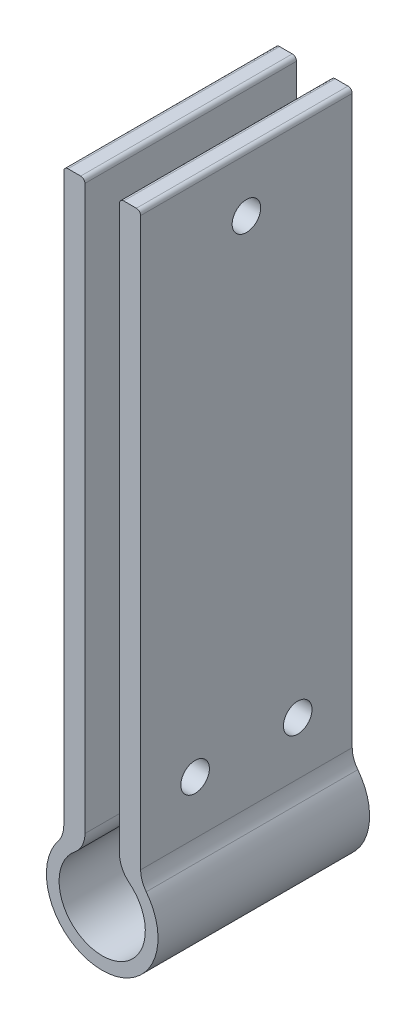
ISO-10303-21;
HEADER;
FILE_DESCRIPTION(('STEP AP214'),'2;1');
FILE_NAME('part.step','',(''),(''),'','','');
FILE_SCHEMA(('AUTOMOTIVE_DESIGN { 1 0 10303 214 1 1 1 1 }'));
ENDSEC;
DATA;
#1=APPLICATION_CONTEXT('core data for automotive mechanical design processes');
#2=APPLICATION_PROTOCOL_DEFINITION('international standard','automotive_design',2000,#1);
#3=PRODUCT_CONTEXT('',#1,'mechanical');
#4=PRODUCT('Part','Part','',(#3));
#5=PRODUCT_RELATED_PRODUCT_CATEGORY('part','',(#4));
#6=PRODUCT_DEFINITION_FORMATION('','',#4);
#7=PRODUCT_DEFINITION_CONTEXT('part definition',#1,'design');
#8=PRODUCT_DEFINITION('design','',#6,#7);
#9=PRODUCT_DEFINITION_SHAPE('','',#8);
#10=(LENGTH_UNIT() NAMED_UNIT(*) SI_UNIT(.MILLI.,.METRE.));
#11=(NAMED_UNIT(*) PLANE_ANGLE_UNIT() SI_UNIT($,.RADIAN.));
#12=(NAMED_UNIT(*) SI_UNIT($,.STERADIAN.) SOLID_ANGLE_UNIT());
#13=UNCERTAINTY_MEASURE_WITH_UNIT(LENGTH_MEASURE(1.E-05),#10,'distance_accuracy_value','');
#14=(GEOMETRIC_REPRESENTATION_CONTEXT(3) GLOBAL_UNCERTAINTY_ASSIGNED_CONTEXT((#13)) GLOBAL_UNIT_ASSIGNED_CONTEXT((#10,
#11,#12)) REPRESENTATION_CONTEXT('',''));
#15=CARTESIAN_POINT('',(0.,0.,0.));
#16=DIRECTION('',(0.,0.,1.));
#17=DIRECTION('',(1.,0.,0.));
#18=AXIS2_PLACEMENT_3D('',#15,#16,#17);
#19=CARTESIAN_POINT('',(3.26601247354487,7.46697144246911,40.));
#20=DIRECTION('',(1.,0.,0.));
#21=DIRECTION('',(0.,0.,-1.));
#22=AXIS2_PLACEMENT_3D('',#19,#20,#21);
#23=PLANE('',#22);
#24=CARTESIAN_POINT('',(3.26601247354487,106.59447777644,20.));
#25=DIRECTION('',(1.,0.,0.));
#26=DIRECTION('',(0.,0.,-1.));
#27=AXIS2_PLACEMENT_3D('',#24,#25,#26);
#28=CIRCLE('',#27,2.69999999999999);
#29=CARTESIAN_POINT('',(3.26601247354487,106.59447777644,17.3));
#30=VERTEX_POINT('',#29);
#31=EDGE_CURVE('E317',#30,#30,#28,.T.);
#32=ORIENTED_EDGE('',*,*,#31,.T.);
#33=EDGE_LOOP('',(#32));
#34=FACE_BOUND('',#33,.T.);
#35=CARTESIAN_POINT('',(3.26601247354487,19.6227536568922,10.2995770141812));
#36=DIRECTION('',(1.,0.,0.));
#37=DIRECTION('',(0.,0.,-1.));
#38=AXIS2_PLACEMENT_3D('',#35,#36,#37);
#39=CIRCLE('',#38,2.7);
#40=CARTESIAN_POINT('',(3.26601247354487,19.6227536568922,7.59957701418123));
#41=VERTEX_POINT('',#40);
#42=EDGE_CURVE('E305',#41,#41,#39,.T.);
#43=ORIENTED_EDGE('',*,*,#42,.T.);
#44=EDGE_LOOP('',(#43));
#45=FACE_BOUND('',#44,.T.);
#46=CARTESIAN_POINT('',(3.26601247354487,19.6227536568922,29.7004229858188));
#47=DIRECTION('',(1.,0.,0.));
#48=DIRECTION('',(0.,0.,-1.));
#49=AXIS2_PLACEMENT_3D('',#46,#47,#48);
#50=CIRCLE('',#49,2.7);
#51=CARTESIAN_POINT('',(3.26601247354487,19.6227536568922,27.0004229858188));
#52=VERTEX_POINT('',#51);
#53=EDGE_CURVE('E278',#52,#52,#50,.T.);
#54=ORIENTED_EDGE('',*,*,#53,.T.);
#55=EDGE_LOOP('',(#54));
#56=FACE_BOUND('',#55,.T.);
#57=DIRECTION('',(0.,-1.,0.));
#58=VECTOR('',#57,1.);
#59=CARTESIAN_POINT('',(3.26601247354487,7.46697144246911,40.));
#60=LINE('',#59,#58);
#61=CARTESIAN_POINT('',(3.26601247354487,116.666971442469,40.));
#62=VERTEX_POINT('',#61);
#63=CARTESIAN_POINT('',(3.26601247354487,10.2271959885005,40.));
#64=VERTEX_POINT('',#63);
#65=EDGE_CURVE('E196',#62,#64,#60,.T.);
#66=ORIENTED_EDGE('',*,*,#65,.F.);
#67=DIRECTION('',(0.,0.,-1.));
#68=VECTOR('',#67,1.);
#69=CARTESIAN_POINT('',(3.26601247354487,116.666971442469,40.));
#70=LINE('',#69,#68);
#71=CARTESIAN_POINT('',(3.26601247354487,116.666971442469,0.));
#72=VERTEX_POINT('',#71);
#73=EDGE_CURVE('E254',#62,#72,#70,.T.);
#74=ORIENTED_EDGE('',*,*,#73,.T.);
#75=DIRECTION('',(0.,-1.,0.));
#76=VECTOR('',#75,1.);
#77=CARTESIAN_POINT('',(3.26601247354487,7.46697144246911,0.));
#78=LINE('',#77,#76);
#79=CARTESIAN_POINT('',(3.26601247354487,10.2271959885005,0.));
#80=VERTEX_POINT('',#79);
#81=EDGE_CURVE('E184',#72,#80,#78,.T.);
#82=ORIENTED_EDGE('',*,*,#81,.T.);
#83=DIRECTION('',(0.,0.,-1.));
#84=VECTOR('',#83,1.);
#85=CARTESIAN_POINT('',(3.26601247354487,10.2271959885005,40.));
#86=LINE('',#85,#84);
#87=EDGE_CURVE('E207',#80,#64,#86,.F.);
#88=ORIENTED_EDGE('',*,*,#87,.T.);
#89=EDGE_LOOP('',(#66,#74,#82,#88));
#90=FACE_BOUND('',#89,.T.);
#91=ADVANCED_FACE('F37',(#34,#45,#56,#90),#23,.F.);
#92=CARTESIAN_POINT('',(0.,0.,40.));
#93=DIRECTION('',(0.,0.,-1.));
#94=DIRECTION('',(-1.,0.,0.));
#95=AXIS2_PLACEMENT_3D('',#92,#93,#94);
#96=CYLINDRICAL_SURFACE('',#95,8.15);
#97=CARTESIAN_POINT('',(0.,0.,0.));
#98=DIRECTION('',(0.,0.,-1.));
#99=DIRECTION('',(1.,0.,0.));
#100=AXIS2_PLACEMENT_3D('',#97,#98,#99);
#101=CIRCLE('',#100,8.15);
#102=CARTESIAN_POINT('',(5.12304195128446,6.33852831226456,0.));
#103=VERTEX_POINT('',#102);
#104=CARTESIAN_POINT('',(-5.12304195128446,6.33852831226456,0.));
#105=VERTEX_POINT('',#104);
#106=EDGE_CURVE('E179',#103,#105,#101,.T.);
#107=ORIENTED_EDGE('',*,*,#106,.T.);
#108=DIRECTION('',(0.,0.,-1.));
#109=VECTOR('',#108,1.);
#110=CARTESIAN_POINT('',(-5.12304195128446,6.33852831226457,40.));
#111=LINE('',#110,#109);
#112=CARTESIAN_POINT('',(-5.12304195128446,6.33852831226456,40.));
#113=VERTEX_POINT('',#112);
#114=EDGE_CURVE('E156',#105,#113,#111,.F.);
#115=ORIENTED_EDGE('',*,*,#114,.T.);
#116=CARTESIAN_POINT('',(0.,0.,40.));
#117=DIRECTION('',(0.,0.,-1.));
#118=DIRECTION('',(1.,0.,0.));
#119=AXIS2_PLACEMENT_3D('',#116,#117,#118);
#120=CIRCLE('',#119,8.15);
#121=CARTESIAN_POINT('',(5.12304195128446,6.33852831226456,40.));
#122=VERTEX_POINT('',#121);
#123=EDGE_CURVE('E273',#122,#113,#120,.T.);
#124=ORIENTED_EDGE('',*,*,#123,.F.);
#125=DIRECTION('',(0.,0.,-1.));
#126=VECTOR('',#125,1.);
#127=CARTESIAN_POINT('',(5.12304195128446,6.33852831226457,40.));
#128=LINE('',#127,#126);
#129=EDGE_CURVE('E161',#122,#103,#128,.T.);
#130=ORIENTED_EDGE('',*,*,#129,.T.);
#131=EDGE_LOOP('',(#107,#115,#124,#130));
#132=FACE_BOUND('',#131,.T.);
#133=ADVANCED_FACE('F361',(#132),#96,.F.);
#134=CARTESIAN_POINT('',(-3.26601247354487,7.46697144246912,40.));
#135=DIRECTION('',(-1.,0.,0.));
#136=DIRECTION('',(0.,0.,1.));
#137=AXIS2_PLACEMENT_3D('',#134,#135,#136);
#138=PLANE('',#137);
#139=CARTESIAN_POINT('',(-3.26601247354487,106.59447777644,20.));
#140=DIRECTION('',(-1.,0.,0.));
#141=DIRECTION('',(0.,0.,1.));
#142=AXIS2_PLACEMENT_3D('',#139,#140,#141);
#143=CIRCLE('',#142,2.69999999999999);
#144=CARTESIAN_POINT('',(-3.26601247354487,106.59447777644,22.7));
#145=VERTEX_POINT('',#144);
#146=EDGE_CURVE('E320',#145,#145,#143,.T.);
#147=ORIENTED_EDGE('',*,*,#146,.T.);
#148=EDGE_LOOP('',(#147));
#149=FACE_BOUND('',#148,.T.);
#150=CARTESIAN_POINT('',(-3.26601247354487,19.6227536568922,10.2995770141812));
#151=DIRECTION('',(-1.,0.,0.));
#152=DIRECTION('',(0.,0.,1.));
#153=AXIS2_PLACEMENT_3D('',#150,#151,#152);
#154=CIRCLE('',#153,2.7);
#155=CARTESIAN_POINT('',(-3.26601247354487,19.6227536568922,12.9995770141812));
#156=VERTEX_POINT('',#155);
#157=EDGE_CURVE('E308',#156,#156,#154,.T.);
#158=ORIENTED_EDGE('',*,*,#157,.T.);
#159=EDGE_LOOP('',(#158));
#160=FACE_BOUND('',#159,.T.);
#161=CARTESIAN_POINT('',(-3.26601247354487,19.6227536568922,29.7004229858188));
#162=DIRECTION('',(-1.,0.,0.));
#163=DIRECTION('',(0.,0.,1.));
#164=AXIS2_PLACEMENT_3D('',#161,#162,#163);
#165=CIRCLE('',#164,2.7);
#166=CARTESIAN_POINT('',(-3.26601247354487,19.6227536568922,32.4004229858188));
#167=VERTEX_POINT('',#166);
#168=EDGE_CURVE('E294',#167,#167,#165,.T.);
#169=ORIENTED_EDGE('',*,*,#168,.T.);
#170=EDGE_LOOP('',(#169));
#171=FACE_BOUND('',#170,.T.);
#172=DIRECTION('',(0.,1.,0.));
#173=VECTOR('',#172,1.);
#174=CARTESIAN_POINT('',(-3.26601247354487,7.46697144246912,0.));
#175=LINE('',#174,#173);
#176=CARTESIAN_POINT('',(-3.26601247354487,10.2271959885005,0.));
#177=VERTEX_POINT('',#176);
#178=CARTESIAN_POINT('',(-3.26601247354487,116.666971442469,0.));
#179=VERTEX_POINT('',#178);
#180=EDGE_CURVE('E168',#177,#179,#175,.T.);
#181=ORIENTED_EDGE('',*,*,#180,.T.);
#182=DIRECTION('',(0.,0.,-1.));
#183=VECTOR('',#182,1.);
#184=CARTESIAN_POINT('',(-3.26601247354487,116.666971442469,40.));
#185=LINE('',#184,#183);
#186=CARTESIAN_POINT('',(-3.26601247354487,116.666971442469,40.));
#187=VERTEX_POINT('',#186);
#188=EDGE_CURVE('E252',#179,#187,#185,.F.);
#189=ORIENTED_EDGE('',*,*,#188,.T.);
#190=DIRECTION('',(0.,1.,0.));
#191=VECTOR('',#190,1.);
#192=CARTESIAN_POINT('',(-3.26601247354487,7.46697144246912,40.));
#193=LINE('',#192,#191);
#194=CARTESIAN_POINT('',(-3.26601247354487,10.2271959885005,40.));
#195=VERTEX_POINT('',#194);
#196=EDGE_CURVE('E171',#195,#187,#193,.T.);
#197=ORIENTED_EDGE('',*,*,#196,.F.);
#198=DIRECTION('',(0.,0.,-1.));
#199=VECTOR('',#198,1.);
#200=CARTESIAN_POINT('',(-3.26601247354487,10.2271959885005,40.));
#201=LINE('',#200,#199);
#202=EDGE_CURVE('E155',#195,#177,#201,.T.);
#203=ORIENTED_EDGE('',*,*,#202,.T.);
#204=EDGE_LOOP('',(#181,#189,#197,#203));
#205=FACE_BOUND('',#204,.T.);
#206=ADVANCED_FACE('F167',(#149,#160,#171,#205),#138,.F.);
#207=CARTESIAN_POINT('',(-3.26601247354487,117.466971442469,40.));
#208=DIRECTION('',(0.,-1.,0.));
#209=DIRECTION('',(0.,0.,-1.));
#210=AXIS2_PLACEMENT_3D('',#207,#208,#209);
#211=PLANE('',#210);
#212=DIRECTION('',(-1.,0.,0.));
#213=VECTOR('',#212,1.);
#214=CARTESIAN_POINT('',(-3.26601247354487,117.466971442469,0.));
#215=LINE('',#214,#213);
#216=CARTESIAN_POINT('',(-4.06601247354487,117.466971442469,0.));
#217=VERTEX_POINT('',#216);
#218=CARTESIAN_POINT('',(-6.46601247354487,117.466971442469,0.));
#219=VERTEX_POINT('',#218);
#220=EDGE_CURVE('E178',#217,#219,#215,.T.);
#221=ORIENTED_EDGE('',*,*,#220,.T.);
#222=DIRECTION('',(0.,0.,-1.));
#223=VECTOR('',#222,1.);
#224=CARTESIAN_POINT('',(-6.46601247354487,117.466971442469,40.));
#225=LINE('',#224,#223);
#226=CARTESIAN_POINT('',(-6.46601247354487,117.466971442469,40.));
#227=VERTEX_POINT('',#226);
#228=EDGE_CURVE('E243',#219,#227,#225,.F.);
#229=ORIENTED_EDGE('',*,*,#228,.T.);
#230=DIRECTION('',(-1.,0.,0.));
#231=VECTOR('',#230,1.);
#232=CARTESIAN_POINT('',(-3.26601247354487,117.466971442469,40.));
#233=LINE('',#232,#231);
#234=CARTESIAN_POINT('',(-4.06601247354487,117.466971442469,40.));
#235=VERTEX_POINT('',#234);
#236=EDGE_CURVE('E282',#235,#227,#233,.T.);
#237=ORIENTED_EDGE('',*,*,#236,.F.);
#238=DIRECTION('',(0.,0.,-1.));
#239=VECTOR('',#238,1.);
#240=CARTESIAN_POINT('',(-4.06601247354487,117.466971442469,40.));
#241=LINE('',#240,#239);
#242=EDGE_CURVE('E240',#235,#217,#241,.T.);
#243=ORIENTED_EDGE('',*,*,#242,.T.);
#244=EDGE_LOOP('',(#221,#229,#237,#243));
#245=FACE_BOUND('',#244,.T.);
#246=ADVANCED_FACE('F337',(#245),#211,.F.);
#247=CARTESIAN_POINT('',(-7.26601247354487,117.466971442469,40.));
#248=DIRECTION('',(1.,0.,0.));
#249=DIRECTION('',(0.,1.,0.));
#250=AXIS2_PLACEMENT_3D('',#247,#248,#249);
#251=PLANE('',#250);
#252=CARTESIAN_POINT('',(-7.26601247354486,106.59447777644,20.));
#253=DIRECTION('',(-1.,0.,0.));
#254=DIRECTION('',(0.,0.,1.));
#255=AXIS2_PLACEMENT_3D('',#252,#253,#254);
#256=CIRCLE('',#255,2.69999999999999);
#257=CARTESIAN_POINT('',(-7.26601247354486,106.59447777644,22.7));
#258=VERTEX_POINT('',#257);
#259=EDGE_CURVE('E326',#258,#258,#256,.T.);
#260=ORIENTED_EDGE('',*,*,#259,.F.);
#261=EDGE_LOOP('',(#260));
#262=FACE_BOUND('',#261,.T.);
#263=CARTESIAN_POINT('',(-7.26601247354486,19.6227536568922,10.2995770141812));
#264=DIRECTION('',(-1.,0.,0.));
#265=DIRECTION('',(0.,0.,1.));
#266=AXIS2_PLACEMENT_3D('',#263,#264,#265);
#267=CIRCLE('',#266,2.7);
#268=CARTESIAN_POINT('',(-7.26601247354486,19.6227536568922,12.9995770141812));
#269=VERTEX_POINT('',#268);
#270=EDGE_CURVE('E314',#269,#269,#267,.T.);
#271=ORIENTED_EDGE('',*,*,#270,.F.);
#272=EDGE_LOOP('',(#271));
#273=FACE_BOUND('',#272,.T.);
#274=CARTESIAN_POINT('',(-7.26601247354486,19.6227536568922,29.7004229858188));
#275=DIRECTION('',(-1.,0.,0.));
#276=DIRECTION('',(0.,0.,1.));
#277=AXIS2_PLACEMENT_3D('',#274,#275,#276);
#278=CIRCLE('',#277,2.7);
#279=CARTESIAN_POINT('',(-7.26601247354486,19.6227536568922,32.4004229858188));
#280=VERTEX_POINT('',#279);
#281=EDGE_CURVE('E301',#280,#280,#278,.T.);
#282=ORIENTED_EDGE('',*,*,#281,.F.);
#283=EDGE_LOOP('',(#282));
#284=FACE_BOUND('',#283,.T.);
#285=DIRECTION('',(0.,-1.,0.));
#286=VECTOR('',#285,1.);
#287=CARTESIAN_POINT('',(-7.26601247354487,117.466971442469,40.));
#288=LINE('',#287,#286);
#289=CARTESIAN_POINT('',(-7.26601247354487,116.666971442469,40.));
#290=VERTEX_POINT('',#289);
#291=CARTESIAN_POINT('',(-7.26601247354486,9.55758536445488,40.));
#292=VERTEX_POINT('',#291);
#293=EDGE_CURVE('E285',#290,#292,#288,.T.);
#294=ORIENTED_EDGE('',*,*,#293,.F.);
#295=DIRECTION('',(0.,0.,-1.));
#296=VECTOR('',#295,1.);
#297=CARTESIAN_POINT('',(-7.26601247354487,116.666971442469,40.));
#298=LINE('',#297,#296);
#299=CARTESIAN_POINT('',(-7.26601247354487,116.666971442469,0.));
#300=VERTEX_POINT('',#299);
#301=EDGE_CURVE('E230',#290,#300,#298,.T.);
#302=ORIENTED_EDGE('',*,*,#301,.T.);
#303=DIRECTION('',(0.,-1.,0.));
#304=VECTOR('',#303,1.);
#305=CARTESIAN_POINT('',(-7.26601247354487,117.466971442469,0.));
#306=LINE('',#305,#304);
#307=CARTESIAN_POINT('',(-7.26601247354486,9.55758536445488,0.));
#308=VERTEX_POINT('',#307);
#309=EDGE_CURVE('E182',#300,#308,#306,.T.);
#310=ORIENTED_EDGE('',*,*,#309,.T.);
#311=DIRECTION('',(0.,0.,1.));
#312=VECTOR('',#311,1.);
#313=CARTESIAN_POINT('',(-7.26601247354486,9.55758536445488,40.));
#314=LINE('',#313,#312);
#315=EDGE_CURVE('E215',#308,#292,#314,.T.);
#316=ORIENTED_EDGE('',*,*,#315,.T.);
#317=EDGE_LOOP('',(#294,#302,#310,#316));
#318=FACE_BOUND('',#317,.T.);
#319=ADVANCED_FACE('F333',(#262,#273,#284,#318),#251,.F.);
#320=CARTESIAN_POINT('',(0.,0.,40.));
#321=DIRECTION('',(0.,0.,-1.));
#322=DIRECTION('',(-1.,0.,0.));
#323=AXIS2_PLACEMENT_3D('',#320,#321,#322);
#324=CYLINDRICAL_SURFACE('',#323,10.55);
#325=CARTESIAN_POINT('',(0.,0.,40.));
#326=DIRECTION('',(0.,0.,1.));
#327=DIRECTION('',(1.,0.,0.));
#328=AXIS2_PLACEMENT_3D('',#325,#326,#327);
#329=CIRCLE('',#328,10.55);
#330=CARTESIAN_POINT('',(-8.32195701581339,6.48440679067517,40.));
#331=VERTEX_POINT('',#330);
#332=CARTESIAN_POINT('',(8.32195701581339,6.48440679067517,40.));
#333=VERTEX_POINT('',#332);
#334=EDGE_CURVE('E287',#331,#333,#329,.T.);
#335=ORIENTED_EDGE('',*,*,#334,.F.);
#336=DIRECTION('',(0.,0.,-1.));
#337=VECTOR('',#336,1.);
#338=CARTESIAN_POINT('',(-8.32195701581339,6.48440679067517,40.));
#339=LINE('',#338,#337);
#340=CARTESIAN_POINT('',(-8.32195701581339,6.48440679067517,0.));
#341=VERTEX_POINT('',#340);
#342=EDGE_CURVE('E212',#331,#341,#339,.T.);
#343=ORIENTED_EDGE('',*,*,#342,.T.);
#344=CARTESIAN_POINT('',(0.,0.,0.));
#345=DIRECTION('',(0.,0.,1.));
#346=DIRECTION('',(1.,0.,0.));
#347=AXIS2_PLACEMENT_3D('',#344,#345,#346);
#348=CIRCLE('',#347,10.55);
#349=CARTESIAN_POINT('',(8.32195701581339,6.48440679067517,0.));
#350=VERTEX_POINT('',#349);
#351=EDGE_CURVE('E189',#341,#350,#348,.T.);
#352=ORIENTED_EDGE('',*,*,#351,.T.);
#353=DIRECTION('',(0.,0.,-1.));
#354=VECTOR('',#353,1.);
#355=CARTESIAN_POINT('',(8.32195701581339,6.48440679067517,40.));
#356=LINE('',#355,#354);
#357=EDGE_CURVE('E210',#350,#333,#356,.F.);
#358=ORIENTED_EDGE('',*,*,#357,.T.);
#359=EDGE_LOOP('',(#335,#343,#352,#358));
#360=FACE_BOUND('',#359,.T.);
#361=ADVANCED_FACE('F336',(#360),#324,.T.);
#362=CARTESIAN_POINT('',(7.26601247354487,117.466971442469,40.));
#363=DIRECTION('',(-1.,0.,0.));
#364=DIRECTION('',(0.,-1.,0.));
#365=AXIS2_PLACEMENT_3D('',#362,#363,#364);
#366=PLANE('',#365);
#367=CARTESIAN_POINT('',(7.26601247354487,106.59447777644,20.));
#368=DIRECTION('',(-1.,0.,0.));
#369=DIRECTION('',(0.,-1.,0.));
#370=AXIS2_PLACEMENT_3D('',#367,#368,#369);
#371=CIRCLE('',#370,2.69999999999999);
#372=CARTESIAN_POINT('',(7.26601247354487,103.89447777644,20.));
#373=VERTEX_POINT('',#372);
#374=EDGE_CURVE('E323',#373,#373,#371,.T.);
#375=ORIENTED_EDGE('',*,*,#374,.T.);
#376=EDGE_LOOP('',(#375));
#377=FACE_BOUND('',#376,.T.);
#378=CARTESIAN_POINT('',(7.26601247354486,19.6227536568922,10.2995770141812));
#379=DIRECTION('',(-1.,0.,0.));
#380=DIRECTION('',(0.,-1.,0.));
#381=AXIS2_PLACEMENT_3D('',#378,#379,#380);
#382=CIRCLE('',#381,2.7);
#383=CARTESIAN_POINT('',(7.26601247354486,16.9227536568922,10.2995770141812));
#384=VERTEX_POINT('',#383);
#385=EDGE_CURVE('E311',#384,#384,#382,.T.);
#386=ORIENTED_EDGE('',*,*,#385,.T.);
#387=EDGE_LOOP('',(#386));
#388=FACE_BOUND('',#387,.T.);
#389=CARTESIAN_POINT('',(7.26601247354486,19.6227536568922,29.7004229858188));
#390=DIRECTION('',(-1.,0.,0.));
#391=DIRECTION('',(0.,-1.,0.));
#392=AXIS2_PLACEMENT_3D('',#389,#390,#391);
#393=CIRCLE('',#392,2.7);
#394=CARTESIAN_POINT('',(7.26601247354486,16.9227536568922,29.7004229858188));
#395=VERTEX_POINT('',#394);
#396=EDGE_CURVE('E41',#395,#395,#393,.T.);
#397=ORIENTED_EDGE('',*,*,#396,.T.);
#398=EDGE_LOOP('',(#397));
#399=FACE_BOUND('',#398,.T.);
#400=DIRECTION('',(0.,1.,0.));
#401=VECTOR('',#400,1.);
#402=CARTESIAN_POINT('',(7.26601247354487,117.466971442469,0.));
#403=LINE('',#402,#401);
#404=CARTESIAN_POINT('',(7.26601247354486,9.55758536445488,0.));
#405=VERTEX_POINT('',#404);
#406=CARTESIAN_POINT('',(7.26601247354487,116.666971442469,0.));
#407=VERTEX_POINT('',#406);
#408=EDGE_CURVE('E192',#405,#407,#403,.T.);
#409=ORIENTED_EDGE('',*,*,#408,.T.);
#410=DIRECTION('',(0.,0.,-1.));
#411=VECTOR('',#410,1.);
#412=CARTESIAN_POINT('',(7.26601247354487,116.666971442469,40.));
#413=LINE('',#412,#411);
#414=CARTESIAN_POINT('',(7.26601247354487,116.666971442469,40.));
#415=VERTEX_POINT('',#414);
#416=EDGE_CURVE('E11',#407,#415,#413,.F.);
#417=ORIENTED_EDGE('',*,*,#416,.T.);
#418=DIRECTION('',(0.,1.,0.));
#419=VECTOR('',#418,1.);
#420=CARTESIAN_POINT('',(7.26601247354487,117.466971442469,40.));
#421=LINE('',#420,#419);
#422=CARTESIAN_POINT('',(7.26601247354486,9.55758536445488,40.));
#423=VERTEX_POINT('',#422);
#424=EDGE_CURVE('E290',#423,#415,#421,.T.);
#425=ORIENTED_EDGE('',*,*,#424,.F.);
#426=DIRECTION('',(0.,0.,1.));
#427=VECTOR('',#426,1.);
#428=CARTESIAN_POINT('',(7.26601247354486,9.55758536445488,0.));
#429=LINE('',#428,#427);
#430=EDGE_CURVE('E218',#423,#405,#429,.F.);
#431=ORIENTED_EDGE('',*,*,#430,.T.);
#432=EDGE_LOOP('',(#409,#417,#425,#431));
#433=FACE_BOUND('',#432,.T.);
#434=ADVANCED_FACE('F391',(#377,#388,#399,#433),#366,.F.);
#435=CARTESIAN_POINT('',(3.26601247354487,117.466971442469,40.));
#436=DIRECTION('',(0.,-1.,0.));
#437=DIRECTION('',(0.,0.,-1.));
#438=AXIS2_PLACEMENT_3D('',#435,#436,#437);
#439=PLANE('',#438);
#440=DIRECTION('',(-1.,0.,0.));
#441=VECTOR('',#440,1.);
#442=CARTESIAN_POINT('',(3.26601247354487,117.466971442469,0.));
#443=LINE('',#442,#441);
#444=CARTESIAN_POINT('',(6.46601247354487,117.466971442469,0.));
#445=VERTEX_POINT('',#444);
#446=CARTESIAN_POINT('',(4.06601247354487,117.466971442469,0.));
#447=VERTEX_POINT('',#446);
#448=EDGE_CURVE('E195',#445,#447,#443,.T.);
#449=ORIENTED_EDGE('',*,*,#448,.T.);
#450=DIRECTION('',(0.,0.,-1.));
#451=VECTOR('',#450,1.);
#452=CARTESIAN_POINT('',(4.06601247354487,117.466971442469,40.));
#453=LINE('',#452,#451);
#454=CARTESIAN_POINT('',(4.06601247354487,117.466971442469,40.));
#455=VERTEX_POINT('',#454);
#456=EDGE_CURVE('E46',#447,#455,#453,.F.);
#457=ORIENTED_EDGE('',*,*,#456,.T.);
#458=DIRECTION('',(-1.,0.,0.));
#459=VECTOR('',#458,1.);
#460=CARTESIAN_POINT('',(3.26601247354487,117.466971442469,40.));
#461=LINE('',#460,#459);
#462=CARTESIAN_POINT('',(6.46601247354487,117.466971442469,40.));
#463=VERTEX_POINT('',#462);
#464=EDGE_CURVE('E172',#463,#455,#461,.T.);
#465=ORIENTED_EDGE('',*,*,#464,.F.);
#466=DIRECTION('',(0.,0.,-1.));
#467=VECTOR('',#466,1.);
#468=CARTESIAN_POINT('',(6.46601247354487,117.466971442469,40.));
#469=LINE('',#468,#467);
#470=EDGE_CURVE('E257',#463,#445,#469,.T.);
#471=ORIENTED_EDGE('',*,*,#470,.T.);
#472=EDGE_LOOP('',(#449,#457,#465,#471));
#473=FACE_BOUND('',#472,.T.);
#474=ADVANCED_FACE('F262',(#473),#439,.F.);
#475=CARTESIAN_POINT('',(0.,0.,40.));
#476=DIRECTION('',(0.,0.,1.));
#477=DIRECTION('',(1.,0.,0.));
#478=AXIS2_PLACEMENT_3D('',#475,#476,#477);
#479=PLANE('',#478);
#480=ORIENTED_EDGE('',*,*,#236,.T.);
#481=CARTESIAN_POINT('',(-6.46601247354487,116.666971442469,40.));
#482=DIRECTION('',(0.,0.,1.));
#483=DIRECTION('',(1.,0.,0.));
#484=AXIS2_PLACEMENT_3D('',#481,#482,#483);
#485=CIRCLE('',#484,0.8);
#486=EDGE_CURVE('E250',#227,#290,#485,.T.);
#487=ORIENTED_EDGE('',*,*,#486,.T.);
#488=ORIENTED_EDGE('',*,*,#293,.T.);
#489=CARTESIAN_POINT('',(-12.2660124735449,9.55758536445488,40.));
#490=DIRECTION('',(0.,0.,1.));
#491=DIRECTION('',(1.,0.,0.));
#492=AXIS2_PLACEMENT_3D('',#489,#490,#491);
#493=CIRCLE('',#492,5.);
#494=EDGE_CURVE('E224',#292,#331,#493,.F.);
#495=ORIENTED_EDGE('',*,*,#494,.T.);
#496=ORIENTED_EDGE('',*,*,#334,.T.);
#497=CARTESIAN_POINT('',(12.2660124735449,9.55758536445488,40.));
#498=DIRECTION('',(0.,0.,1.));
#499=DIRECTION('',(1.,0.,0.));
#500=AXIS2_PLACEMENT_3D('',#497,#498,#499);
#501=CIRCLE('',#500,5.);
#502=EDGE_CURVE('E228',#333,#423,#501,.F.);
#503=ORIENTED_EDGE('',*,*,#502,.T.);
#504=ORIENTED_EDGE('',*,*,#424,.T.);
#505=CARTESIAN_POINT('',(6.46601247354487,116.666971442469,40.));
#506=DIRECTION('',(0.,0.,1.));
#507=DIRECTION('',(1.,0.,0.));
#508=AXIS2_PLACEMENT_3D('',#505,#506,#507);
#509=CIRCLE('',#508,0.8);
#510=EDGE_CURVE('E245',#415,#463,#509,.T.);
#511=ORIENTED_EDGE('',*,*,#510,.T.);
#512=ORIENTED_EDGE('',*,*,#464,.T.);
#513=CARTESIAN_POINT('',(4.06601247354487,116.666971442469,40.));
#514=DIRECTION('',(0.,0.,1.));
#515=DIRECTION('',(1.,0.,0.));
#516=AXIS2_PLACEMENT_3D('',#513,#514,#515);
#517=CIRCLE('',#516,0.8);
#518=EDGE_CURVE('E53',#455,#62,#517,.T.);
#519=ORIENTED_EDGE('',*,*,#518,.T.);
#520=ORIENTED_EDGE('',*,*,#65,.T.);
#521=CARTESIAN_POINT('',(8.26601247354487,10.2271959885005,40.));
#522=DIRECTION('',(0.,0.,1.));
#523=DIRECTION('',(1.,0.,0.));
#524=AXIS2_PLACEMENT_3D('',#521,#522,#523);
#525=CIRCLE('',#524,5.);
#526=EDGE_CURVE('E203',#64,#122,#525,.T.);
#527=ORIENTED_EDGE('',*,*,#526,.T.);
#528=ORIENTED_EDGE('',*,*,#123,.T.);
#529=CARTESIAN_POINT('',(-8.26601247354487,10.2271959885005,40.));
#530=DIRECTION('',(0.,0.,1.));
#531=DIRECTION('',(1.,0.,0.));
#532=AXIS2_PLACEMENT_3D('',#529,#530,#531);
#533=CIRCLE('',#532,5.);
#534=EDGE_CURVE('E205',#113,#195,#533,.T.);
#535=ORIENTED_EDGE('',*,*,#534,.T.);
#536=ORIENTED_EDGE('',*,*,#196,.T.);
#537=CARTESIAN_POINT('',(-4.06601247354487,116.666971442469,40.));
#538=DIRECTION('',(0.,0.,1.));
#539=DIRECTION('',(1.,0.,0.));
#540=AXIS2_PLACEMENT_3D('',#537,#538,#539);
#541=CIRCLE('',#540,0.8);
#542=EDGE_CURVE('E248',#187,#235,#541,.T.);
#543=ORIENTED_EDGE('',*,*,#542,.T.);
#544=EDGE_LOOP('',(#480,#487,#488,#495,#496,#503,#504,#511,#512,#519,#520,#527,#528,#535,#536,#543));
#545=FACE_BOUND('',#544,.T.);
#546=ADVANCED_FACE('F357',(#545),#479,.T.);
#547=CARTESIAN_POINT('',(0.,0.,0.));
#548=DIRECTION('',(0.,0.,1.));
#549=DIRECTION('',(1.,0.,0.));
#550=AXIS2_PLACEMENT_3D('',#547,#548,#549);
#551=PLANE('',#550);
#552=ORIENTED_EDGE('',*,*,#309,.F.);
#553=CARTESIAN_POINT('',(-6.46601247354487,116.666971442469,0.));
#554=DIRECTION('',(0.,0.,1.));
#555=DIRECTION('',(1.,0.,0.));
#556=AXIS2_PLACEMENT_3D('',#553,#554,#555);
#557=CIRCLE('',#556,0.8);
#558=EDGE_CURVE('E238',#300,#219,#557,.F.);
#559=ORIENTED_EDGE('',*,*,#558,.T.);
#560=ORIENTED_EDGE('',*,*,#220,.F.);
#561=CARTESIAN_POINT('',(-4.06601247354487,116.666971442469,0.));
#562=DIRECTION('',(0.,0.,1.));
#563=DIRECTION('',(1.,0.,0.));
#564=AXIS2_PLACEMENT_3D('',#561,#562,#563);
#565=CIRCLE('',#564,0.8);
#566=EDGE_CURVE('E177',#217,#179,#565,.F.);
#567=ORIENTED_EDGE('',*,*,#566,.T.);
#568=ORIENTED_EDGE('',*,*,#180,.F.);
#569=CARTESIAN_POINT('',(-8.26601247354487,10.2271959885005,0.));
#570=DIRECTION('',(0.,0.,1.));
#571=DIRECTION('',(1.,0.,0.));
#572=AXIS2_PLACEMENT_3D('',#569,#570,#571);
#573=CIRCLE('',#572,5.);
#574=EDGE_CURVE('E151',#177,#105,#573,.F.);
#575=ORIENTED_EDGE('',*,*,#574,.T.);
#576=ORIENTED_EDGE('',*,*,#106,.F.);
#577=CARTESIAN_POINT('',(8.26601247354487,10.2271959885005,0.));
#578=DIRECTION('',(0.,0.,1.));
#579=DIRECTION('',(1.,0.,0.));
#580=AXIS2_PLACEMENT_3D('',#577,#578,#579);
#581=CIRCLE('',#580,5.);
#582=EDGE_CURVE('E162',#103,#80,#581,.F.);
#583=ORIENTED_EDGE('',*,*,#582,.T.);
#584=ORIENTED_EDGE('',*,*,#81,.F.);
#585=CARTESIAN_POINT('',(4.06601247354487,116.666971442469,0.));
#586=DIRECTION('',(0.,0.,1.));
#587=DIRECTION('',(1.,0.,0.));
#588=AXIS2_PLACEMENT_3D('',#585,#586,#587);
#589=CIRCLE('',#588,0.8);
#590=EDGE_CURVE('E235',#72,#447,#589,.F.);
#591=ORIENTED_EDGE('',*,*,#590,.T.);
#592=ORIENTED_EDGE('',*,*,#448,.F.);
#593=CARTESIAN_POINT('',(6.46601247354487,116.666971442469,0.));
#594=DIRECTION('',(0.,0.,1.));
#595=DIRECTION('',(1.,0.,0.));
#596=AXIS2_PLACEMENT_3D('',#593,#594,#595);
#597=CIRCLE('',#596,0.8);
#598=EDGE_CURVE('E233',#445,#407,#597,.F.);
#599=ORIENTED_EDGE('',*,*,#598,.T.);
#600=ORIENTED_EDGE('',*,*,#408,.F.);
#601=CARTESIAN_POINT('',(12.2660124735449,9.55758536445488,0.));
#602=DIRECTION('',(0.,0.,1.));
#603=DIRECTION('',(1.,0.,0.));
#604=AXIS2_PLACEMENT_3D('',#601,#602,#603);
#605=CIRCLE('',#604,5.);
#606=EDGE_CURVE('E226',#405,#350,#605,.T.);
#607=ORIENTED_EDGE('',*,*,#606,.T.);
#608=ORIENTED_EDGE('',*,*,#351,.F.);
#609=CARTESIAN_POINT('',(-12.2660124735449,9.55758536445488,0.));
#610=DIRECTION('',(0.,0.,1.));
#611=DIRECTION('',(1.,0.,0.));
#612=AXIS2_PLACEMENT_3D('',#609,#610,#611);
#613=CIRCLE('',#612,5.);
#614=EDGE_CURVE('E221',#341,#308,#613,.T.);
#615=ORIENTED_EDGE('',*,*,#614,.T.);
#616=EDGE_LOOP('',(#552,#559,#560,#567,#568,#575,#576,#583,#584,#591,#592,#599,#600,#607,#608,#615));
#617=FACE_BOUND('',#616,.T.);
#618=ADVANCED_FACE('F175',(#617),#551,.F.);
#619=CARTESIAN_POINT('',(-8.26601247354487,10.2271959885005,40.));
#620=DIRECTION('',(0.,0.,-1.));
#621=DIRECTION('',(-1.,0.,0.));
#622=AXIS2_PLACEMENT_3D('',#619,#620,#621);
#623=CYLINDRICAL_SURFACE('',#622,5.);
#624=ORIENTED_EDGE('',*,*,#534,.F.);
#625=ORIENTED_EDGE('',*,*,#114,.F.);
#626=ORIENTED_EDGE('',*,*,#574,.F.);
#627=ORIENTED_EDGE('',*,*,#202,.F.);
#628=EDGE_LOOP('',(#624,#625,#626,#627));
#629=FACE_BOUND('',#628,.T.);
#630=ADVANCED_FACE('F154',(#629),#623,.T.);
#631=CARTESIAN_POINT('',(8.26601247354487,10.2271959885005,40.));
#632=DIRECTION('',(0.,0.,-1.));
#633=DIRECTION('',(-1.,0.,0.));
#634=AXIS2_PLACEMENT_3D('',#631,#632,#633);
#635=CYLINDRICAL_SURFACE('',#634,5.);
#636=ORIENTED_EDGE('',*,*,#526,.F.);
#637=ORIENTED_EDGE('',*,*,#87,.F.);
#638=ORIENTED_EDGE('',*,*,#582,.F.);
#639=ORIENTED_EDGE('',*,*,#129,.F.);
#640=EDGE_LOOP('',(#636,#637,#638,#639));
#641=FACE_BOUND('',#640,.T.);
#642=ADVANCED_FACE('F363',(#641),#635,.T.);
#643=CARTESIAN_POINT('',(-12.2660124735449,9.55758536445488,40.));
#644=DIRECTION('',(0.,0.,-1.));
#645=DIRECTION('',(-1.,0.,0.));
#646=AXIS2_PLACEMENT_3D('',#643,#644,#645);
#647=CYLINDRICAL_SURFACE('',#646,5.);
#648=ORIENTED_EDGE('',*,*,#494,.F.);
#649=ORIENTED_EDGE('',*,*,#315,.F.);
#650=ORIENTED_EDGE('',*,*,#614,.F.);
#651=ORIENTED_EDGE('',*,*,#342,.F.);
#652=EDGE_LOOP('',(#648,#649,#650,#651));
#653=FACE_BOUND('',#652,.T.);
#654=ADVANCED_FACE('F365',(#653),#647,.F.);
#655=CARTESIAN_POINT('',(12.2660124735449,9.55758536445488,40.));
#656=DIRECTION('',(0.,0.,-1.));
#657=DIRECTION('',(-1.,0.,0.));
#658=AXIS2_PLACEMENT_3D('',#655,#656,#657);
#659=CYLINDRICAL_SURFACE('',#658,5.);
#660=ORIENTED_EDGE('',*,*,#502,.F.);
#661=ORIENTED_EDGE('',*,*,#357,.F.);
#662=ORIENTED_EDGE('',*,*,#606,.F.);
#663=ORIENTED_EDGE('',*,*,#430,.F.);
#664=EDGE_LOOP('',(#660,#661,#662,#663));
#665=FACE_BOUND('',#664,.T.);
#666=ADVANCED_FACE('F371',(#665),#659,.F.);
#667=CARTESIAN_POINT('',(-6.46601247354487,116.666971442469,40.));
#668=DIRECTION('',(0.,0.,-1.));
#669=DIRECTION('',(-1.,0.,0.));
#670=AXIS2_PLACEMENT_3D('',#667,#668,#669);
#671=CYLINDRICAL_SURFACE('',#670,0.8);
#672=ORIENTED_EDGE('',*,*,#486,.F.);
#673=ORIENTED_EDGE('',*,*,#228,.F.);
#674=ORIENTED_EDGE('',*,*,#558,.F.);
#675=ORIENTED_EDGE('',*,*,#301,.F.);
#676=EDGE_LOOP('',(#672,#673,#674,#675));
#677=FACE_BOUND('',#676,.T.);
#678=ADVANCED_FACE('F349',(#677),#671,.T.);
#679=CARTESIAN_POINT('',(-4.06601247354487,116.666971442469,40.));
#680=DIRECTION('',(0.,0.,-1.));
#681=DIRECTION('',(-1.,0.,0.));
#682=AXIS2_PLACEMENT_3D('',#679,#680,#681);
#683=CYLINDRICAL_SURFACE('',#682,0.8);
#684=ORIENTED_EDGE('',*,*,#542,.F.);
#685=ORIENTED_EDGE('',*,*,#188,.F.);
#686=ORIENTED_EDGE('',*,*,#566,.F.);
#687=ORIENTED_EDGE('',*,*,#242,.F.);
#688=EDGE_LOOP('',(#684,#685,#686,#687));
#689=FACE_BOUND('',#688,.T.);
#690=ADVANCED_FACE('F356',(#689),#683,.T.);
#691=CARTESIAN_POINT('',(4.06601247354487,116.666971442469,40.));
#692=DIRECTION('',(0.,0.,-1.));
#693=DIRECTION('',(-1.,0.,0.));
#694=AXIS2_PLACEMENT_3D('',#691,#692,#693);
#695=CYLINDRICAL_SURFACE('',#694,0.8);
#696=ORIENTED_EDGE('',*,*,#518,.F.);
#697=ORIENTED_EDGE('',*,*,#456,.F.);
#698=ORIENTED_EDGE('',*,*,#590,.F.);
#699=ORIENTED_EDGE('',*,*,#73,.F.);
#700=EDGE_LOOP('',(#696,#697,#698,#699));
#701=FACE_BOUND('',#700,.T.);
#702=ADVANCED_FACE('F269',(#701),#695,.T.);
#703=CARTESIAN_POINT('',(6.46601247354487,116.666971442469,40.));
#704=DIRECTION('',(0.,0.,-1.));
#705=DIRECTION('',(-1.,0.,0.));
#706=AXIS2_PLACEMENT_3D('',#703,#704,#705);
#707=CYLINDRICAL_SURFACE('',#706,0.8);
#708=ORIENTED_EDGE('',*,*,#510,.F.);
#709=ORIENTED_EDGE('',*,*,#416,.F.);
#710=ORIENTED_EDGE('',*,*,#598,.F.);
#711=ORIENTED_EDGE('',*,*,#470,.F.);
#712=EDGE_LOOP('',(#708,#709,#710,#711));
#713=FACE_BOUND('',#712,.T.);
#714=ADVANCED_FACE('F39',(#713),#707,.T.);
#715=CARTESIAN_POINT('',(-7.26601247354486,19.6227536568922,29.7004229858188));
#716=DIRECTION('',(-1.,0.,0.));
#717=DIRECTION('',(0.,0.,1.));
#718=AXIS2_PLACEMENT_3D('',#715,#716,#717);
#719=CYLINDRICAL_SURFACE('',#718,2.7);
#720=ORIENTED_EDGE('',*,*,#396,.F.);
#721=EDGE_LOOP('',(#720));
#722=FACE_BOUND('',#721,.T.);
#723=ORIENTED_EDGE('',*,*,#53,.F.);
#724=EDGE_LOOP('',(#723));
#725=FACE_BOUND('',#724,.T.);
#726=ADVANCED_FACE('F402',(#722,#725),#719,.F.);
#727=ORIENTED_EDGE('',*,*,#281,.T.);
#728=EDGE_LOOP('',(#727));
#729=FACE_BOUND('',#728,.T.);
#730=ORIENTED_EDGE('',*,*,#168,.F.);
#731=EDGE_LOOP('',(#730));
#732=FACE_BOUND('',#731,.T.);
#733=ADVANCED_FACE('F405',(#729,#732),#719,.F.);
#734=CARTESIAN_POINT('',(-7.26601247354486,19.6227536568922,10.2995770141812));
#735=DIRECTION('',(-1.,0.,0.));
#736=DIRECTION('',(0.,0.,1.));
#737=AXIS2_PLACEMENT_3D('',#734,#735,#736);
#738=CYLINDRICAL_SURFACE('',#737,2.7);
#739=ORIENTED_EDGE('',*,*,#270,.T.);
#740=EDGE_LOOP('',(#739));
#741=FACE_BOUND('',#740,.T.);
#742=ORIENTED_EDGE('',*,*,#157,.F.);
#743=EDGE_LOOP('',(#742));
#744=FACE_BOUND('',#743,.T.);
#745=ADVANCED_FACE('F410',(#741,#744),#738,.F.);
#746=ORIENTED_EDGE('',*,*,#385,.F.);
#747=EDGE_LOOP('',(#746));
#748=FACE_BOUND('',#747,.T.);
#749=ORIENTED_EDGE('',*,*,#42,.F.);
#750=EDGE_LOOP('',(#749));
#751=FACE_BOUND('',#750,.T.);
#752=ADVANCED_FACE('F407',(#748,#751),#738,.F.);
#753=CARTESIAN_POINT('',(-7.26601247354486,106.59447777644,20.));
#754=DIRECTION('',(-1.,0.,0.));
#755=DIRECTION('',(0.,0.,1.));
#756=AXIS2_PLACEMENT_3D('',#753,#754,#755);
#757=CYLINDRICAL_SURFACE('',#756,2.69999999999999);
#758=ORIENTED_EDGE('',*,*,#259,.T.);
#759=EDGE_LOOP('',(#758));
#760=FACE_BOUND('',#759,.T.);
#761=ORIENTED_EDGE('',*,*,#146,.F.);
#762=EDGE_LOOP('',(#761));
#763=FACE_BOUND('',#762,.T.);
#764=ADVANCED_FACE('F330',(#760,#763),#757,.F.);
#765=ORIENTED_EDGE('',*,*,#374,.F.);
#766=EDGE_LOOP('',(#765));
#767=FACE_BOUND('',#766,.T.);
#768=ORIENTED_EDGE('',*,*,#31,.F.);
#769=EDGE_LOOP('',(#768));
#770=FACE_BOUND('',#769,.T.);
#771=ADVANCED_FACE('F412',(#767,#770),#757,.F.);
#772=CLOSED_SHELL('',(#91,#133,#206,#246,#319,#361,#434,#474,#546,#618,#630,#642,#654,#666,#678,
#690,#702,#714,#726,#733,#745,#752,#764,#771));
#773=MANIFOLD_SOLID_BREP('B2',#772);
#774=ADVANCED_BREP_SHAPE_REPRESENTATION('',(#18,#773),#14);
#775=SHAPE_DEFINITION_REPRESENTATION(#9,#774);
ENDSEC;
END-ISO-10303-21;
